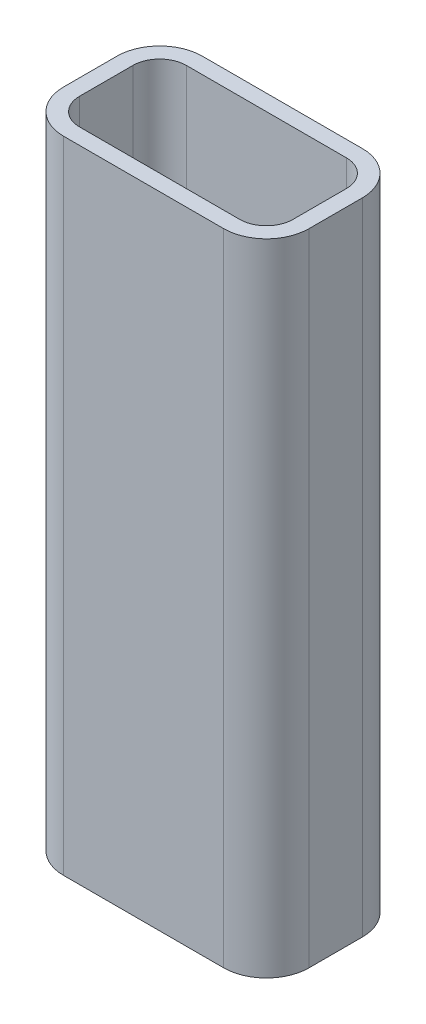
ISO-10303-21;
HEADER;
FILE_DESCRIPTION(('STEP AP214'),'2;1');
FILE_NAME('part.step','',(''),(''),'','','');
FILE_SCHEMA(('AUTOMOTIVE_DESIGN { 1 0 10303 214 1 1 1 1 }'));
ENDSEC;
DATA;
#1=APPLICATION_CONTEXT('core data for automotive mechanical design processes');
#2=APPLICATION_PROTOCOL_DEFINITION('international standard','automotive_design',2000,#1);
#3=PRODUCT_CONTEXT('',#1,'mechanical');
#4=PRODUCT('Part','Part','',(#3));
#5=PRODUCT_RELATED_PRODUCT_CATEGORY('part','',(#4));
#6=PRODUCT_DEFINITION_FORMATION('','',#4);
#7=PRODUCT_DEFINITION_CONTEXT('part definition',#1,'design');
#8=PRODUCT_DEFINITION('design','',#6,#7);
#9=PRODUCT_DEFINITION_SHAPE('','',#8);
#10=(LENGTH_UNIT() NAMED_UNIT(*) SI_UNIT(.MILLI.,.METRE.));
#11=(NAMED_UNIT(*) PLANE_ANGLE_UNIT() SI_UNIT($,.RADIAN.));
#12=(NAMED_UNIT(*) SI_UNIT($,.STERADIAN.) SOLID_ANGLE_UNIT());
#13=UNCERTAINTY_MEASURE_WITH_UNIT(LENGTH_MEASURE(1.E-05),#10,'distance_accuracy_value','');
#14=(GEOMETRIC_REPRESENTATION_CONTEXT(3) GLOBAL_UNCERTAINTY_ASSIGNED_CONTEXT((#13)) GLOBAL_UNIT_ASSIGNED_CONTEXT((#10,
#11,#12)) REPRESENTATION_CONTEXT('',''));
#15=CARTESIAN_POINT('',(0.,0.,0.));
#16=DIRECTION('',(0.,0.,1.));
#17=DIRECTION('',(1.,0.,0.));
#18=AXIS2_PLACEMENT_3D('',#15,#16,#17);
#19=CARTESIAN_POINT('',(-15.,120.,-5.));
#20=DIRECTION('',(0.,1.,0.));
#21=DIRECTION('',(0.,0.,1.));
#22=AXIS2_PLACEMENT_3D('',#19,#20,#21);
#23=PLANE('',#22);
#24=CARTESIAN_POINT('',(-15.,120.,-5.));
#25=DIRECTION('',(0.,1.,0.));
#26=DIRECTION('',(1.,0.,0.));
#27=AXIS2_PLACEMENT_3D('',#24,#25,#26);
#28=CIRCLE('',#27,8.);
#29=CARTESIAN_POINT('',(-15.,120.,-13.));
#30=VERTEX_POINT('',#29);
#31=CARTESIAN_POINT('',(-23.,120.,-5.));
#32=VERTEX_POINT('',#31);
#33=EDGE_CURVE('E292',#30,#32,#28,.T.);
#34=ORIENTED_EDGE('',*,*,#33,.T.);
#35=DIRECTION('',(0.,0.,1.));
#36=VECTOR('',#35,1.);
#37=CARTESIAN_POINT('',(-23.,120.,5.));
#38=LINE('',#37,#36);
#39=CARTESIAN_POINT('',(-23.,120.,5.));
#40=VERTEX_POINT('',#39);
#41=EDGE_CURVE('E296',#32,#40,#38,.T.);
#42=ORIENTED_EDGE('',*,*,#41,.T.);
#43=CARTESIAN_POINT('',(-15.,120.,5.));
#44=DIRECTION('',(0.,1.,0.));
#45=DIRECTION('',(1.,0.,0.));
#46=AXIS2_PLACEMENT_3D('',#43,#44,#45);
#47=CIRCLE('',#46,8.);
#48=CARTESIAN_POINT('',(-15.,120.,13.));
#49=VERTEX_POINT('',#48);
#50=EDGE_CURVE('E300',#40,#49,#47,.T.);
#51=ORIENTED_EDGE('',*,*,#50,.T.);
#52=DIRECTION('',(1.,0.,0.));
#53=VECTOR('',#52,1.);
#54=CARTESIAN_POINT('',(15.,120.,13.));
#55=LINE('',#54,#53);
#56=CARTESIAN_POINT('',(15.,120.,13.));
#57=VERTEX_POINT('',#56);
#58=EDGE_CURVE('E303',#49,#57,#55,.T.);
#59=ORIENTED_EDGE('',*,*,#58,.T.);
#60=CARTESIAN_POINT('',(15.,120.,5.));
#61=DIRECTION('',(0.,1.,0.));
#62=DIRECTION('',(1.,0.,0.));
#63=AXIS2_PLACEMENT_3D('',#60,#61,#62);
#64=CIRCLE('',#63,8.);
#65=CARTESIAN_POINT('',(23.,120.,5.));
#66=VERTEX_POINT('',#65);
#67=EDGE_CURVE('E306',#57,#66,#64,.T.);
#68=ORIENTED_EDGE('',*,*,#67,.T.);
#69=DIRECTION('',(0.,0.,-1.));
#70=VECTOR('',#69,1.);
#71=CARTESIAN_POINT('',(23.,120.,5.));
#72=LINE('',#71,#70);
#73=CARTESIAN_POINT('',(23.,120.,-5.));
#74=VERTEX_POINT('',#73);
#75=EDGE_CURVE('E309',#66,#74,#72,.T.);
#76=ORIENTED_EDGE('',*,*,#75,.T.);
#77=CARTESIAN_POINT('',(15.,120.,-5.));
#78=DIRECTION('',(0.,1.,0.));
#79=DIRECTION('',(1.,0.,0.));
#80=AXIS2_PLACEMENT_3D('',#77,#78,#79);
#81=CIRCLE('',#80,8.);
#82=CARTESIAN_POINT('',(15.,120.,-13.));
#83=VERTEX_POINT('',#82);
#84=EDGE_CURVE('E312',#74,#83,#81,.T.);
#85=ORIENTED_EDGE('',*,*,#84,.T.);
#86=DIRECTION('',(-1.,0.,0.));
#87=VECTOR('',#86,1.);
#88=CARTESIAN_POINT('',(15.,120.,-13.));
#89=LINE('',#88,#87);
#90=EDGE_CURVE('E315',#83,#30,#89,.T.);
#91=ORIENTED_EDGE('',*,*,#90,.T.);
#92=EDGE_LOOP('',(#34,#42,#51,#59,#68,#76,#85,#91));
#93=FACE_BOUND('',#92,.T.);
#94=DIRECTION('',(0.,0.,1.));
#95=VECTOR('',#94,1.);
#96=CARTESIAN_POINT('',(-20.,120.,5.));
#97=LINE('',#96,#95);
#98=CARTESIAN_POINT('',(-20.,120.,-5.));
#99=VERTEX_POINT('',#98);
#100=CARTESIAN_POINT('',(-20.,120.,5.));
#101=VERTEX_POINT('',#100);
#102=EDGE_CURVE('E212',#99,#101,#97,.T.);
#103=ORIENTED_EDGE('',*,*,#102,.F.);
#104=CARTESIAN_POINT('',(-15.,120.,-5.));
#105=DIRECTION('',(0.,1.,0.));
#106=DIRECTION('',(0.,0.,1.));
#107=AXIS2_PLACEMENT_3D('',#104,#105,#106);
#108=CIRCLE('',#107,5.);
#109=CARTESIAN_POINT('',(-15.,120.,-10.));
#110=VERTEX_POINT('',#109);
#111=EDGE_CURVE('E203',#110,#99,#108,.T.);
#112=ORIENTED_EDGE('',*,*,#111,.F.);
#113=DIRECTION('',(-1.,0.,0.));
#114=VECTOR('',#113,1.);
#115=CARTESIAN_POINT('',(15.,120.,-10.));
#116=LINE('',#115,#114);
#117=CARTESIAN_POINT('',(15.,120.,-10.));
#118=VERTEX_POINT('',#117);
#119=EDGE_CURVE('E244',#118,#110,#116,.T.);
#120=ORIENTED_EDGE('',*,*,#119,.F.);
#121=CARTESIAN_POINT('',(15.,120.,-5.));
#122=DIRECTION('',(0.,1.,0.));
#123=DIRECTION('',(0.,0.,1.));
#124=AXIS2_PLACEMENT_3D('',#121,#122,#123);
#125=CIRCLE('',#124,5.);
#126=CARTESIAN_POINT('',(20.,120.,-5.));
#127=VERTEX_POINT('',#126);
#128=EDGE_CURVE('E241',#127,#118,#125,.T.);
#129=ORIENTED_EDGE('',*,*,#128,.F.);
#130=DIRECTION('',(0.,0.,-1.));
#131=VECTOR('',#130,1.);
#132=CARTESIAN_POINT('',(20.,120.,5.));
#133=LINE('',#132,#131);
#134=CARTESIAN_POINT('',(20.,120.,5.));
#135=VERTEX_POINT('',#134);
#136=EDGE_CURVE('E238',#135,#127,#133,.T.);
#137=ORIENTED_EDGE('',*,*,#136,.F.);
#138=CARTESIAN_POINT('',(15.,120.,5.));
#139=DIRECTION('',(0.,1.,0.));
#140=DIRECTION('',(0.,0.,1.));
#141=AXIS2_PLACEMENT_3D('',#138,#139,#140);
#142=CIRCLE('',#141,5.);
#143=CARTESIAN_POINT('',(15.,120.,10.));
#144=VERTEX_POINT('',#143);
#145=EDGE_CURVE('E235',#144,#135,#142,.T.);
#146=ORIENTED_EDGE('',*,*,#145,.F.);
#147=DIRECTION('',(1.,0.,0.));
#148=VECTOR('',#147,1.);
#149=CARTESIAN_POINT('',(15.,120.,10.));
#150=LINE('',#149,#148);
#151=CARTESIAN_POINT('',(-15.,120.,10.));
#152=VERTEX_POINT('',#151);
#153=EDGE_CURVE('E230',#152,#144,#150,.T.);
#154=ORIENTED_EDGE('',*,*,#153,.F.);
#155=CARTESIAN_POINT('',(-15.,120.,5.));
#156=DIRECTION('',(0.,1.,0.));
#157=DIRECTION('',(0.,0.,-1.));
#158=AXIS2_PLACEMENT_3D('',#155,#156,#157);
#159=CIRCLE('',#158,5.);
#160=EDGE_CURVE('E226',#101,#152,#159,.T.);
#161=ORIENTED_EDGE('',*,*,#160,.F.);
#162=EDGE_LOOP('',(#103,#112,#120,#129,#137,#146,#154,#161));
#163=FACE_BOUND('',#162,.T.);
#164=ADVANCED_FACE('F89',(#93,#163),#23,.T.);
#165=CARTESIAN_POINT('',(-15.,0.,-5.));
#166=DIRECTION('',(0.,1.,0.));
#167=DIRECTION('',(0.,0.,1.));
#168=AXIS2_PLACEMENT_3D('',#165,#166,#167);
#169=PLANE('',#168);
#170=CARTESIAN_POINT('',(-15.,0.,-5.));
#171=DIRECTION('',(0.,1.,0.));
#172=DIRECTION('',(1.,0.,0.));
#173=AXIS2_PLACEMENT_3D('',#170,#171,#172);
#174=CIRCLE('',#173,8.);
#175=CARTESIAN_POINT('',(-15.,0.,-13.));
#176=VERTEX_POINT('',#175);
#177=CARTESIAN_POINT('',(-23.,0.,-5.));
#178=VERTEX_POINT('',#177);
#179=EDGE_CURVE('E221',#176,#178,#174,.T.);
#180=ORIENTED_EDGE('',*,*,#179,.F.);
#181=DIRECTION('',(-1.,0.,0.));
#182=VECTOR('',#181,1.);
#183=CARTESIAN_POINT('',(15.,0.,-13.));
#184=LINE('',#183,#182);
#185=CARTESIAN_POINT('',(15.,0.,-13.));
#186=VERTEX_POINT('',#185);
#187=EDGE_CURVE('E297',#186,#176,#184,.T.);
#188=ORIENTED_EDGE('',*,*,#187,.F.);
#189=CARTESIAN_POINT('',(15.,0.,-5.));
#190=DIRECTION('',(0.,1.,0.));
#191=DIRECTION('',(1.,0.,0.));
#192=AXIS2_PLACEMENT_3D('',#189,#190,#191);
#193=CIRCLE('',#192,8.);
#194=CARTESIAN_POINT('',(23.,0.,-5.));
#195=VERTEX_POINT('',#194);
#196=EDGE_CURVE('E337',#195,#186,#193,.T.);
#197=ORIENTED_EDGE('',*,*,#196,.F.);
#198=DIRECTION('',(0.,0.,-1.));
#199=VECTOR('',#198,1.);
#200=CARTESIAN_POINT('',(23.,0.,5.));
#201=LINE('',#200,#199);
#202=CARTESIAN_POINT('',(23.,0.,5.));
#203=VERTEX_POINT('',#202);
#204=EDGE_CURVE('E334',#203,#195,#201,.T.);
#205=ORIENTED_EDGE('',*,*,#204,.F.);
#206=CARTESIAN_POINT('',(15.,0.,5.));
#207=DIRECTION('',(0.,1.,0.));
#208=DIRECTION('',(1.,0.,0.));
#209=AXIS2_PLACEMENT_3D('',#206,#207,#208);
#210=CIRCLE('',#209,8.);
#211=CARTESIAN_POINT('',(15.,0.,13.));
#212=VERTEX_POINT('',#211);
#213=EDGE_CURVE('E331',#212,#203,#210,.T.);
#214=ORIENTED_EDGE('',*,*,#213,.F.);
#215=DIRECTION('',(1.,0.,0.));
#216=VECTOR('',#215,1.);
#217=CARTESIAN_POINT('',(15.,0.,13.));
#218=LINE('',#217,#216);
#219=CARTESIAN_POINT('',(-15.,0.,13.));
#220=VERTEX_POINT('',#219);
#221=EDGE_CURVE('E328',#220,#212,#218,.T.);
#222=ORIENTED_EDGE('',*,*,#221,.F.);
#223=CARTESIAN_POINT('',(-15.,0.,5.));
#224=DIRECTION('',(0.,1.,0.));
#225=DIRECTION('',(1.,0.,0.));
#226=AXIS2_PLACEMENT_3D('',#223,#224,#225);
#227=CIRCLE('',#226,8.);
#228=CARTESIAN_POINT('',(-23.,0.,5.));
#229=VERTEX_POINT('',#228);
#230=EDGE_CURVE('E325',#229,#220,#227,.T.);
#231=ORIENTED_EDGE('',*,*,#230,.F.);
#232=DIRECTION('',(0.,0.,1.));
#233=VECTOR('',#232,1.);
#234=CARTESIAN_POINT('',(-23.,0.,5.));
#235=LINE('',#234,#233);
#236=EDGE_CURVE('E322',#178,#229,#235,.T.);
#237=ORIENTED_EDGE('',*,*,#236,.F.);
#238=EDGE_LOOP('',(#180,#188,#197,#205,#214,#222,#231,#237));
#239=FACE_BOUND('',#238,.T.);
#240=CARTESIAN_POINT('',(-15.,0.,-5.));
#241=DIRECTION('',(0.,1.,0.));
#242=DIRECTION('',(0.,0.,1.));
#243=AXIS2_PLACEMENT_3D('',#240,#241,#242);
#244=CIRCLE('',#243,5.);
#245=CARTESIAN_POINT('',(-15.,0.,-10.));
#246=VERTEX_POINT('',#245);
#247=CARTESIAN_POINT('',(-20.,0.,-5.));
#248=VERTEX_POINT('',#247);
#249=EDGE_CURVE('E113',#246,#248,#244,.T.);
#250=ORIENTED_EDGE('',*,*,#249,.T.);
#251=DIRECTION('',(0.,0.,1.));
#252=VECTOR('',#251,1.);
#253=CARTESIAN_POINT('',(-20.,0.,5.));
#254=LINE('',#253,#252);
#255=CARTESIAN_POINT('',(-20.,0.,5.));
#256=VERTEX_POINT('',#255);
#257=EDGE_CURVE('E219',#248,#256,#254,.T.);
#258=ORIENTED_EDGE('',*,*,#257,.T.);
#259=CARTESIAN_POINT('',(-15.,0.,5.));
#260=DIRECTION('',(0.,1.,0.));
#261=DIRECTION('',(0.,0.,-1.));
#262=AXIS2_PLACEMENT_3D('',#259,#260,#261);
#263=CIRCLE('',#262,5.);
#264=CARTESIAN_POINT('',(-15.,0.,10.));
#265=VERTEX_POINT('',#264);
#266=EDGE_CURVE('E251',#256,#265,#263,.T.);
#267=ORIENTED_EDGE('',*,*,#266,.T.);
#268=DIRECTION('',(1.,0.,0.));
#269=VECTOR('',#268,1.);
#270=CARTESIAN_POINT('',(15.,0.,10.));
#271=LINE('',#270,#269);
#272=CARTESIAN_POINT('',(15.,0.,10.));
#273=VERTEX_POINT('',#272);
#274=EDGE_CURVE('E255',#265,#273,#271,.T.);
#275=ORIENTED_EDGE('',*,*,#274,.T.);
#276=CARTESIAN_POINT('',(15.,0.,5.));
#277=DIRECTION('',(0.,1.,0.));
#278=DIRECTION('',(0.,0.,1.));
#279=AXIS2_PLACEMENT_3D('',#276,#277,#278);
#280=CIRCLE('',#279,5.);
#281=CARTESIAN_POINT('',(20.,0.,5.));
#282=VERTEX_POINT('',#281);
#283=EDGE_CURVE('E259',#273,#282,#280,.T.);
#284=ORIENTED_EDGE('',*,*,#283,.T.);
#285=DIRECTION('',(0.,0.,-1.));
#286=VECTOR('',#285,1.);
#287=CARTESIAN_POINT('',(20.,0.,5.));
#288=LINE('',#287,#286);
#289=CARTESIAN_POINT('',(20.,0.,-5.));
#290=VERTEX_POINT('',#289);
#291=EDGE_CURVE('E263',#282,#290,#288,.T.);
#292=ORIENTED_EDGE('',*,*,#291,.T.);
#293=CARTESIAN_POINT('',(15.,0.,-5.));
#294=DIRECTION('',(0.,1.,0.));
#295=DIRECTION('',(0.,0.,1.));
#296=AXIS2_PLACEMENT_3D('',#293,#294,#295);
#297=CIRCLE('',#296,5.);
#298=CARTESIAN_POINT('',(15.,0.,-10.));
#299=VERTEX_POINT('',#298);
#300=EDGE_CURVE('E267',#290,#299,#297,.T.);
#301=ORIENTED_EDGE('',*,*,#300,.T.);
#302=DIRECTION('',(-1.,0.,0.));
#303=VECTOR('',#302,1.);
#304=CARTESIAN_POINT('',(15.,0.,-10.));
#305=LINE('',#304,#303);
#306=EDGE_CURVE('E213',#299,#246,#305,.T.);
#307=ORIENTED_EDGE('',*,*,#306,.T.);
#308=EDGE_LOOP('',(#250,#258,#267,#275,#284,#292,#301,#307));
#309=FACE_BOUND('',#308,.T.);
#310=ADVANCED_FACE('F376',(#239,#309),#169,.F.);
#311=CARTESIAN_POINT('',(-15.,120.,-5.));
#312=DIRECTION('',(0.,-1.,0.));
#313=DIRECTION('',(0.,0.,-1.));
#314=AXIS2_PLACEMENT_3D('',#311,#312,#313);
#315=CYLINDRICAL_SURFACE('',#314,8.);
#316=ORIENTED_EDGE('',*,*,#179,.T.);
#317=DIRECTION('',(0.,-1.,0.));
#318=VECTOR('',#317,1.);
#319=CARTESIAN_POINT('',(-23.,120.,-5.));
#320=LINE('',#319,#318);
#321=EDGE_CURVE('E12',#32,#178,#320,.T.);
#322=ORIENTED_EDGE('',*,*,#321,.F.);
#323=ORIENTED_EDGE('',*,*,#33,.F.);
#324=DIRECTION('',(0.,-1.,0.));
#325=VECTOR('',#324,1.);
#326=CARTESIAN_POINT('',(-15.,120.,-13.));
#327=LINE('',#326,#325);
#328=EDGE_CURVE('E318',#30,#176,#327,.T.);
#329=ORIENTED_EDGE('',*,*,#328,.T.);
#330=EDGE_LOOP('',(#316,#322,#323,#329));
#331=FACE_BOUND('',#330,.T.);
#332=ADVANCED_FACE('F91',(#331),#315,.T.);
#333=CARTESIAN_POINT('',(-23.,120.,5.));
#334=DIRECTION('',(1.,0.,0.));
#335=DIRECTION('',(0.,0.,-1.));
#336=AXIS2_PLACEMENT_3D('',#333,#334,#335);
#337=PLANE('',#336);
#338=ORIENTED_EDGE('',*,*,#236,.T.);
#339=DIRECTION('',(0.,-1.,0.));
#340=VECTOR('',#339,1.);
#341=CARTESIAN_POINT('',(-23.,120.,5.));
#342=LINE('',#341,#340);
#343=EDGE_CURVE('E98',#40,#229,#342,.T.);
#344=ORIENTED_EDGE('',*,*,#343,.F.);
#345=ORIENTED_EDGE('',*,*,#41,.F.);
#346=ORIENTED_EDGE('',*,*,#321,.T.);
#347=EDGE_LOOP('',(#338,#344,#345,#346));
#348=FACE_BOUND('',#347,.T.);
#349=ADVANCED_FACE('F393',(#348),#337,.F.);
#350=CARTESIAN_POINT('',(-15.,120.,5.));
#351=DIRECTION('',(0.,-1.,0.));
#352=DIRECTION('',(0.,0.,-1.));
#353=AXIS2_PLACEMENT_3D('',#350,#351,#352);
#354=CYLINDRICAL_SURFACE('',#353,8.);
#355=ORIENTED_EDGE('',*,*,#230,.T.);
#356=DIRECTION('',(0.,-1.,0.));
#357=VECTOR('',#356,1.);
#358=CARTESIAN_POINT('',(-15.,120.,13.));
#359=LINE('',#358,#357);
#360=EDGE_CURVE('E361',#49,#220,#359,.T.);
#361=ORIENTED_EDGE('',*,*,#360,.F.);
#362=ORIENTED_EDGE('',*,*,#50,.F.);
#363=ORIENTED_EDGE('',*,*,#343,.T.);
#364=EDGE_LOOP('',(#355,#361,#362,#363));
#365=FACE_BOUND('',#364,.T.);
#366=ADVANCED_FACE('F370',(#365),#354,.T.);
#367=CARTESIAN_POINT('',(15.,120.,13.));
#368=DIRECTION('',(0.,0.,-1.));
#369=DIRECTION('',(-1.,0.,0.));
#370=AXIS2_PLACEMENT_3D('',#367,#368,#369);
#371=PLANE('',#370);
#372=ORIENTED_EDGE('',*,*,#221,.T.);
#373=DIRECTION('',(0.,-1.,0.));
#374=VECTOR('',#373,1.);
#375=CARTESIAN_POINT('',(15.,120.,13.));
#376=LINE('',#375,#374);
#377=EDGE_CURVE('E357',#57,#212,#376,.T.);
#378=ORIENTED_EDGE('',*,*,#377,.F.);
#379=ORIENTED_EDGE('',*,*,#58,.F.);
#380=ORIENTED_EDGE('',*,*,#360,.T.);
#381=EDGE_LOOP('',(#372,#378,#379,#380));
#382=FACE_BOUND('',#381,.T.);
#383=ADVANCED_FACE('F382',(#382),#371,.F.);
#384=CARTESIAN_POINT('',(15.,120.,5.));
#385=DIRECTION('',(0.,-1.,0.));
#386=DIRECTION('',(0.,0.,-1.));
#387=AXIS2_PLACEMENT_3D('',#384,#385,#386);
#388=CYLINDRICAL_SURFACE('',#387,8.);
#389=ORIENTED_EDGE('',*,*,#213,.T.);
#390=DIRECTION('',(0.,-1.,0.));
#391=VECTOR('',#390,1.);
#392=CARTESIAN_POINT('',(23.,120.,5.));
#393=LINE('',#392,#391);
#394=EDGE_CURVE('E353',#66,#203,#393,.T.);
#395=ORIENTED_EDGE('',*,*,#394,.F.);
#396=ORIENTED_EDGE('',*,*,#67,.F.);
#397=ORIENTED_EDGE('',*,*,#377,.T.);
#398=EDGE_LOOP('',(#389,#395,#396,#397));
#399=FACE_BOUND('',#398,.T.);
#400=ADVANCED_FACE('F386',(#399),#388,.T.);
#401=CARTESIAN_POINT('',(23.,120.,5.));
#402=DIRECTION('',(-1.,0.,0.));
#403=DIRECTION('',(0.,0.,1.));
#404=AXIS2_PLACEMENT_3D('',#401,#402,#403);
#405=PLANE('',#404);
#406=ORIENTED_EDGE('',*,*,#204,.T.);
#407=DIRECTION('',(0.,-1.,0.));
#408=VECTOR('',#407,1.);
#409=CARTESIAN_POINT('',(23.,120.,-5.));
#410=LINE('',#409,#408);
#411=EDGE_CURVE('E349',#74,#195,#410,.T.);
#412=ORIENTED_EDGE('',*,*,#411,.F.);
#413=ORIENTED_EDGE('',*,*,#75,.F.);
#414=ORIENTED_EDGE('',*,*,#394,.T.);
#415=EDGE_LOOP('',(#406,#412,#413,#414));
#416=FACE_BOUND('',#415,.T.);
#417=ADVANCED_FACE('F406',(#416),#405,.F.);
#418=CARTESIAN_POINT('',(15.,120.,-5.));
#419=DIRECTION('',(0.,-1.,0.));
#420=DIRECTION('',(0.,0.,-1.));
#421=AXIS2_PLACEMENT_3D('',#418,#419,#420);
#422=CYLINDRICAL_SURFACE('',#421,8.);
#423=ORIENTED_EDGE('',*,*,#196,.T.);
#424=DIRECTION('',(0.,-1.,0.));
#425=VECTOR('',#424,1.);
#426=CARTESIAN_POINT('',(15.,120.,-13.));
#427=LINE('',#426,#425);
#428=EDGE_CURVE('E345',#83,#186,#427,.T.);
#429=ORIENTED_EDGE('',*,*,#428,.F.);
#430=ORIENTED_EDGE('',*,*,#84,.F.);
#431=ORIENTED_EDGE('',*,*,#411,.T.);
#432=EDGE_LOOP('',(#423,#429,#430,#431));
#433=FACE_BOUND('',#432,.T.);
#434=ADVANCED_FACE('F404',(#433),#422,.T.);
#435=CARTESIAN_POINT('',(15.,120.,-13.));
#436=DIRECTION('',(0.,0.,1.));
#437=DIRECTION('',(1.,0.,0.));
#438=AXIS2_PLACEMENT_3D('',#435,#436,#437);
#439=PLANE('',#438);
#440=ORIENTED_EDGE('',*,*,#187,.T.);
#441=ORIENTED_EDGE('',*,*,#328,.F.);
#442=ORIENTED_EDGE('',*,*,#90,.F.);
#443=ORIENTED_EDGE('',*,*,#428,.T.);
#444=EDGE_LOOP('',(#440,#441,#442,#443));
#445=FACE_BOUND('',#444,.T.);
#446=ADVANCED_FACE('F399',(#445),#439,.F.);
#447=CARTESIAN_POINT('',(-15.,120.,-5.));
#448=DIRECTION('',(0.,-1.,0.));
#449=DIRECTION('',(0.,0.,-1.));
#450=AXIS2_PLACEMENT_3D('',#447,#448,#449);
#451=CYLINDRICAL_SURFACE('',#450,5.);
#452=ORIENTED_EDGE('',*,*,#249,.F.);
#453=DIRECTION('',(0.,-1.,0.));
#454=VECTOR('',#453,1.);
#455=CARTESIAN_POINT('',(-15.,120.,-10.));
#456=LINE('',#455,#454);
#457=EDGE_CURVE('E207',#110,#246,#456,.T.);
#458=ORIENTED_EDGE('',*,*,#457,.F.);
#459=ORIENTED_EDGE('',*,*,#111,.T.);
#460=DIRECTION('',(0.,-1.,0.));
#461=VECTOR('',#460,1.);
#462=CARTESIAN_POINT('',(-20.,120.,-5.));
#463=LINE('',#462,#461);
#464=EDGE_CURVE('E206',#99,#248,#463,.T.);
#465=ORIENTED_EDGE('',*,*,#464,.T.);
#466=EDGE_LOOP('',(#452,#458,#459,#465));
#467=FACE_BOUND('',#466,.T.);
#468=ADVANCED_FACE('F205',(#467),#451,.F.);
#469=CARTESIAN_POINT('',(-20.,120.,5.));
#470=DIRECTION('',(1.,0.,0.));
#471=DIRECTION('',(0.,0.,-1.));
#472=AXIS2_PLACEMENT_3D('',#469,#470,#471);
#473=PLANE('',#472);
#474=ORIENTED_EDGE('',*,*,#257,.F.);
#475=ORIENTED_EDGE('',*,*,#464,.F.);
#476=ORIENTED_EDGE('',*,*,#102,.T.);
#477=DIRECTION('',(0.,-1.,0.));
#478=VECTOR('',#477,1.);
#479=CARTESIAN_POINT('',(-20.,120.,5.));
#480=LINE('',#479,#478);
#481=EDGE_CURVE('E222',#101,#256,#480,.T.);
#482=ORIENTED_EDGE('',*,*,#481,.T.);
#483=EDGE_LOOP('',(#474,#475,#476,#482));
#484=FACE_BOUND('',#483,.T.);
#485=ADVANCED_FACE('F216',(#484),#473,.T.);
#486=CARTESIAN_POINT('',(-15.,120.,5.));
#487=DIRECTION('',(0.,-1.,0.));
#488=DIRECTION('',(0.,0.,-1.));
#489=AXIS2_PLACEMENT_3D('',#486,#487,#488);
#490=CYLINDRICAL_SURFACE('',#489,5.);
#491=ORIENTED_EDGE('',*,*,#266,.F.);
#492=ORIENTED_EDGE('',*,*,#481,.F.);
#493=ORIENTED_EDGE('',*,*,#160,.T.);
#494=DIRECTION('',(0.,-1.,0.));
#495=VECTOR('',#494,1.);
#496=CARTESIAN_POINT('',(-15.,120.,10.));
#497=LINE('',#496,#495);
#498=EDGE_CURVE('E287',#152,#265,#497,.T.);
#499=ORIENTED_EDGE('',*,*,#498,.T.);
#500=EDGE_LOOP('',(#491,#492,#493,#499));
#501=FACE_BOUND('',#500,.T.);
#502=ADVANCED_FACE('F431',(#501),#490,.F.);
#503=CARTESIAN_POINT('',(15.,120.,10.));
#504=DIRECTION('',(0.,0.,-1.));
#505=DIRECTION('',(-1.,0.,0.));
#506=AXIS2_PLACEMENT_3D('',#503,#504,#505);
#507=PLANE('',#506);
#508=ORIENTED_EDGE('',*,*,#274,.F.);
#509=ORIENTED_EDGE('',*,*,#498,.F.);
#510=ORIENTED_EDGE('',*,*,#153,.T.);
#511=DIRECTION('',(0.,-1.,0.));
#512=VECTOR('',#511,1.);
#513=CARTESIAN_POINT('',(15.,120.,10.));
#514=LINE('',#513,#512);
#515=EDGE_CURVE('E284',#144,#273,#514,.T.);
#516=ORIENTED_EDGE('',*,*,#515,.T.);
#517=EDGE_LOOP('',(#508,#509,#510,#516));
#518=FACE_BOUND('',#517,.T.);
#519=ADVANCED_FACE('F435',(#518),#507,.T.);
#520=CARTESIAN_POINT('',(15.,120.,5.));
#521=DIRECTION('',(0.,-1.,0.));
#522=DIRECTION('',(0.,0.,-1.));
#523=AXIS2_PLACEMENT_3D('',#520,#521,#522);
#524=CYLINDRICAL_SURFACE('',#523,5.);
#525=ORIENTED_EDGE('',*,*,#283,.F.);
#526=ORIENTED_EDGE('',*,*,#515,.F.);
#527=ORIENTED_EDGE('',*,*,#145,.T.);
#528=DIRECTION('',(0.,-1.,0.));
#529=VECTOR('',#528,1.);
#530=CARTESIAN_POINT('',(20.,120.,5.));
#531=LINE('',#530,#529);
#532=EDGE_CURVE('E281',#135,#282,#531,.T.);
#533=ORIENTED_EDGE('',*,*,#532,.T.);
#534=EDGE_LOOP('',(#525,#526,#527,#533));
#535=FACE_BOUND('',#534,.T.);
#536=ADVANCED_FACE('F441',(#535),#524,.F.);
#537=CARTESIAN_POINT('',(20.,120.,5.));
#538=DIRECTION('',(-1.,0.,0.));
#539=DIRECTION('',(0.,0.,1.));
#540=AXIS2_PLACEMENT_3D('',#537,#538,#539);
#541=PLANE('',#540);
#542=ORIENTED_EDGE('',*,*,#291,.F.);
#543=ORIENTED_EDGE('',*,*,#532,.F.);
#544=ORIENTED_EDGE('',*,*,#136,.T.);
#545=DIRECTION('',(0.,-1.,0.));
#546=VECTOR('',#545,1.);
#547=CARTESIAN_POINT('',(20.,120.,-5.));
#548=LINE('',#547,#546);
#549=EDGE_CURVE('E278',#127,#290,#548,.T.);
#550=ORIENTED_EDGE('',*,*,#549,.T.);
#551=EDGE_LOOP('',(#542,#543,#544,#550));
#552=FACE_BOUND('',#551,.T.);
#553=ADVANCED_FACE('F445',(#552),#541,.T.);
#554=CARTESIAN_POINT('',(15.,120.,-5.));
#555=DIRECTION('',(0.,-1.,0.));
#556=DIRECTION('',(0.,0.,-1.));
#557=AXIS2_PLACEMENT_3D('',#554,#555,#556);
#558=CYLINDRICAL_SURFACE('',#557,5.);
#559=ORIENTED_EDGE('',*,*,#300,.F.);
#560=ORIENTED_EDGE('',*,*,#549,.F.);
#561=ORIENTED_EDGE('',*,*,#128,.T.);
#562=DIRECTION('',(0.,-1.,0.));
#563=VECTOR('',#562,1.);
#564=CARTESIAN_POINT('',(15.,120.,-10.));
#565=LINE('',#564,#563);
#566=EDGE_CURVE('E105',#118,#299,#565,.T.);
#567=ORIENTED_EDGE('',*,*,#566,.T.);
#568=EDGE_LOOP('',(#559,#560,#561,#567));
#569=FACE_BOUND('',#568,.T.);
#570=ADVANCED_FACE('F449',(#569),#558,.F.);
#571=CARTESIAN_POINT('',(15.,120.,-10.));
#572=DIRECTION('',(0.,0.,1.));
#573=DIRECTION('',(1.,0.,0.));
#574=AXIS2_PLACEMENT_3D('',#571,#572,#573);
#575=PLANE('',#574);
#576=ORIENTED_EDGE('',*,*,#306,.F.);
#577=ORIENTED_EDGE('',*,*,#566,.F.);
#578=ORIENTED_EDGE('',*,*,#119,.T.);
#579=ORIENTED_EDGE('',*,*,#457,.T.);
#580=EDGE_LOOP('',(#576,#577,#578,#579));
#581=FACE_BOUND('',#580,.T.);
#582=ADVANCED_FACE('F453',(#581),#575,.T.);
#583=CLOSED_SHELL('',(#164,#310,#332,#349,#366,#383,#400,#417,#434,#446,#468,#485,#502,#519,
#536,#553,#570,#582));
#584=MANIFOLD_SOLID_BREP('B2',#583);
#585=ADVANCED_BREP_SHAPE_REPRESENTATION('',(#18,#584),#14);
#586=SHAPE_DEFINITION_REPRESENTATION(#9,#585);
ENDSEC;
END-ISO-10303-21;
